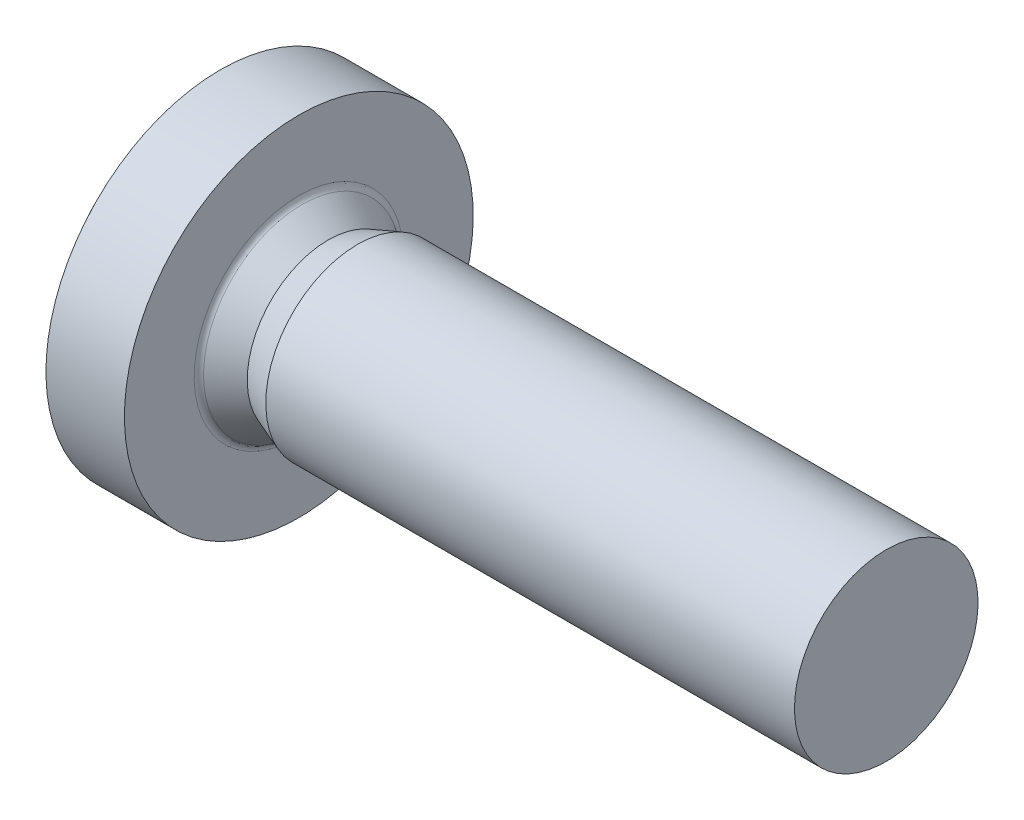
ISO-10303-21;
HEADER;
FILE_DESCRIPTION(('STEP AP214'),'2;1');
FILE_NAME('part.step','',(''),(''),'','','');
FILE_SCHEMA(('AUTOMOTIVE_DESIGN { 1 0 10303 214 1 1 1 1 }'));
ENDSEC;
DATA;
#1=APPLICATION_CONTEXT('core data for automotive mechanical design processes');
#2=APPLICATION_PROTOCOL_DEFINITION('international standard','automotive_design',2000,#1);
#3=PRODUCT_CONTEXT('',#1,'mechanical');
#4=PRODUCT('Part','Part','',(#3));
#5=PRODUCT_RELATED_PRODUCT_CATEGORY('part','',(#4));
#6=PRODUCT_DEFINITION_FORMATION('','',#4);
#7=PRODUCT_DEFINITION_CONTEXT('part definition',#1,'design');
#8=PRODUCT_DEFINITION('design','',#6,#7);
#9=PRODUCT_DEFINITION_SHAPE('','',#8);
#10=(LENGTH_UNIT() NAMED_UNIT(*) SI_UNIT(.MILLI.,.METRE.));
#11=(NAMED_UNIT(*) PLANE_ANGLE_UNIT() SI_UNIT($,.RADIAN.));
#12=(NAMED_UNIT(*) SI_UNIT($,.STERADIAN.) SOLID_ANGLE_UNIT());
#13=UNCERTAINTY_MEASURE_WITH_UNIT(LENGTH_MEASURE(1.E-05),#10,'distance_accuracy_value','');
#14=(GEOMETRIC_REPRESENTATION_CONTEXT(3) GLOBAL_UNCERTAINTY_ASSIGNED_CONTEXT((#13)) GLOBAL_UNIT_ASSIGNED_CONTEXT((#10,
#11,#12)) REPRESENTATION_CONTEXT('',''));
#15=CARTESIAN_POINT('',(0.,0.,0.));
#16=DIRECTION('',(0.,0.,1.));
#17=DIRECTION('',(1.,0.,0.));
#18=AXIS2_PLACEMENT_3D('',#15,#16,#17);
#19=CARTESIAN_POINT('',(16.,1.25,0.));
#20=DIRECTION('',(1.,0.,0.));
#21=DIRECTION('',(0.,1.,0.));
#22=AXIS2_PLACEMENT_3D('',#19,#20,#21);
#23=PLANE('',#22);
#24=CARTESIAN_POINT('',(16.,0.,0.));
#25=DIRECTION('',(1.,0.,0.));
#26=DIRECTION('',(0.,1.,0.));
#27=AXIS2_PLACEMENT_3D('',#24,#25,#26);
#28=CIRCLE('',#27,2.5);
#29=CARTESIAN_POINT('',(16.,2.5,0.));
#30=VERTEX_POINT('',#29);
#31=EDGE_CURVE('E11',#30,#30,#28,.T.);
#32=ORIENTED_EDGE('',*,*,#31,.T.);
#33=EDGE_LOOP('',(#32));
#34=FACE_BOUND('',#33,.T.);
#35=ADVANCED_FACE('F19',(#34),#23,.T.);
#36=CARTESIAN_POINT('',(8.8,0.,0.));
#37=DIRECTION('',(-1.,0.,0.));
#38=DIRECTION('',(0.,1.,0.));
#39=AXIS2_PLACEMENT_3D('',#36,#37,#38);
#40=CYLINDRICAL_SURFACE('',#39,2.5);
#41=CARTESIAN_POINT('',(1.6,0.,0.));
#42=DIRECTION('',(1.,0.,0.));
#43=DIRECTION('',(0.,1.,0.));
#44=AXIS2_PLACEMENT_3D('',#41,#42,#43);
#45=CIRCLE('',#44,2.5);
#46=CARTESIAN_POINT('',(1.6,2.5,0.));
#47=VERTEX_POINT('',#46);
#48=EDGE_CURVE('E29',#47,#47,#45,.T.);
#49=ORIENTED_EDGE('',*,*,#48,.T.);
#50=EDGE_LOOP('',(#49));
#51=FACE_BOUND('',#50,.T.);
#52=ORIENTED_EDGE('',*,*,#31,.F.);
#53=EDGE_LOOP('',(#52));
#54=FACE_BOUND('',#53,.T.);
#55=ADVANCED_FACE('F375',(#51,#54),#40,.T.);
#56=CARTESIAN_POINT('',(1.2,0.,0.));
#57=DIRECTION('',(1.,0.,0.));
#58=DIRECTION('',(0.,1.,0.));
#59=AXIS2_PLACEMENT_3D('',#56,#57,#58);
#60=CONICAL_SURFACE('',#59,2.352125,0.35410502091143);
#61=CARTESIAN_POINT('',(0.8,0.,0.));
#62=DIRECTION('',(1.,0.,0.));
#63=DIRECTION('',(0.,1.,0.));
#64=AXIS2_PLACEMENT_3D('',#61,#62,#63);
#65=CIRCLE('',#64,2.20425);
#66=CARTESIAN_POINT('',(0.8,2.20425,0.));
#67=VERTEX_POINT('',#66);
#68=EDGE_CURVE('E212',#67,#67,#65,.T.);
#69=ORIENTED_EDGE('',*,*,#68,.T.);
#70=EDGE_LOOP('',(#69));
#71=FACE_BOUND('',#70,.T.);
#72=ORIENTED_EDGE('',*,*,#48,.F.);
#73=EDGE_LOOP('',(#72));
#74=FACE_BOUND('',#73,.T.);
#75=ADVANCED_FACE('F379',(#71,#74),#60,.T.);
#76=CARTESIAN_POINT('',(0.444096618275084,0.,0.));
#77=DIRECTION('',(-1.,0.,0.));
#78=DIRECTION('',(0.,1.,0.));
#79=AXIS2_PLACEMENT_3D('',#76,#77,#78);
#80=CONICAL_SURFACE('',#79,2.44421051446388,0.593220065438029);
#81=CARTESIAN_POINT('',(0.0881932365501674,0.,0.));
#82=DIRECTION('',(1.,0.,0.));
#83=DIRECTION('',(0.,1.,0.));
#84=AXIS2_PLACEMENT_3D('',#81,#82,#83);
#85=CIRCLE('',#84,2.68417102892776);
#86=CARTESIAN_POINT('',(0.088193236550167,2.68417102892776,0.));
#87=VERTEX_POINT('',#86);
#88=EDGE_CURVE('E180',#87,#87,#85,.T.);
#89=ORIENTED_EDGE('',*,*,#88,.T.);
#90=EDGE_LOOP('',(#89));
#91=FACE_BOUND('',#90,.T.);
#92=ORIENTED_EDGE('',*,*,#68,.F.);
#93=EDGE_LOOP('',(#92));
#94=FACE_BOUND('',#93,.T.);
#95=ADVANCED_FACE('F421',(#91,#94),#80,.T.);
#96=CARTESIAN_POINT('',(0.2,0.,0.));
#97=DIRECTION('',(1.,0.,0.));
#98=DIRECTION('',(0.,0.,-1.));
#99=AXIS2_PLACEMENT_3D('',#96,#97,#98);
#100=TOROIDAL_SURFACE('',#99,2.85,0.2);
#101=CARTESIAN_POINT('',(0.,0.,0.));
#102=DIRECTION('',(1.,0.,0.));
#103=DIRECTION('',(0.,1.,0.));
#104=AXIS2_PLACEMENT_3D('',#101,#102,#103);
#105=CIRCLE('',#104,2.85);
#106=CARTESIAN_POINT('',(0.,2.85,0.));
#107=VERTEX_POINT('',#106);
#108=EDGE_CURVE('E178',#107,#107,#105,.T.);
#109=ORIENTED_EDGE('',*,*,#108,.T.);
#110=EDGE_LOOP('',(#109));
#111=FACE_BOUND('',#110,.T.);
#112=ORIENTED_EDGE('',*,*,#88,.F.);
#113=EDGE_LOOP('',(#112));
#114=FACE_BOUND('',#113,.T.);
#115=ADVANCED_FACE('F425',(#111,#114),#100,.F.);
#116=CARTESIAN_POINT('',(0.,3.8,0.));
#117=DIRECTION('',(1.,0.,0.));
#118=DIRECTION('',(0.,1.,0.));
#119=AXIS2_PLACEMENT_3D('',#116,#117,#118);
#120=PLANE('',#119);
#121=CARTESIAN_POINT('',(0.,0.,0.));
#122=DIRECTION('',(1.,0.,0.));
#123=DIRECTION('',(0.,1.,0.));
#124=AXIS2_PLACEMENT_3D('',#121,#122,#123);
#125=CIRCLE('',#124,4.75);
#126=CARTESIAN_POINT('',(0.,4.75,0.));
#127=VERTEX_POINT('',#126);
#128=EDGE_CURVE('E181',#127,#127,#125,.T.);
#129=ORIENTED_EDGE('',*,*,#128,.T.);
#130=EDGE_LOOP('',(#129));
#131=FACE_BOUND('',#130,.T.);
#132=ORIENTED_EDGE('',*,*,#108,.F.);
#133=EDGE_LOOP('',(#132));
#134=FACE_BOUND('',#133,.T.);
#135=ADVANCED_FACE('F435',(#131,#134),#120,.T.);
#136=CARTESIAN_POINT('',(-1.06859829739593,0.,0.));
#137=DIRECTION('',(-1.,0.,0.));
#138=DIRECTION('',(0.,1.,0.));
#139=AXIS2_PLACEMENT_3D('',#136,#137,#138);
#140=CYLINDRICAL_SURFACE('',#139,4.75);
#141=CARTESIAN_POINT('',(-2.13719659479187,0.,0.));
#142=DIRECTION('',(1.,0.,0.));
#143=DIRECTION('',(0.,1.,0.));
#144=AXIS2_PLACEMENT_3D('',#141,#142,#143);
#145=CIRCLE('',#144,4.75);
#146=CARTESIAN_POINT('',(-2.13719659479186,4.75,0.));
#147=VERTEX_POINT('',#146);
#148=EDGE_CURVE('E261',#147,#147,#145,.T.);
#149=ORIENTED_EDGE('',*,*,#148,.T.);
#150=EDGE_LOOP('',(#149));
#151=FACE_BOUND('',#150,.T.);
#152=ORIENTED_EDGE('',*,*,#128,.F.);
#153=EDGE_LOOP('',(#152));
#154=FACE_BOUND('',#153,.T.);
#155=ADVANCED_FACE('F408',(#151,#154),#140,.T.);
#156=CARTESIAN_POINT('',(4.3,0.,0.));
#157=DIRECTION('',(0.,0.,1.));
#158=DIRECTION('',(1.,0.,0.));
#159=AXIS2_PLACEMENT_3D('',#156,#157,#158);
#160=SPHERICAL_SURFACE('',#159,8.);
#161=ORIENTED_EDGE('',*,*,#148,.F.);
#162=EDGE_LOOP('',(#161));
#163=FACE_BOUND('',#162,.T.);
#164=CARTESIAN_POINT('',(4.3,2.45,0.));
#165=DIRECTION('',(0.,1.,0.));
#166=DIRECTION('',(0.,0.,-1.));
#167=AXIS2_PLACEMENT_3D('',#164,#165,#166);
#168=CIRCLE('',#167,7.61560897105412);
#169=CARTESIAN_POINT('',(-3.29982894544345,2.45,-0.49));
#170=VERTEX_POINT('',#169);
#171=CARTESIAN_POINT('',(-3.29982894544345,2.45,0.49));
#172=VERTEX_POINT('',#171);
#173=EDGE_CURVE('E158',#170,#172,#168,.T.);
#174=ORIENTED_EDGE('',*,*,#173,.T.);
#175=CARTESIAN_POINT('',(4.3,-0.0239333009683529,0.273558881846001));
#176=DIRECTION('',(0.,-0.0871557427476582,0.996194698091746));
#177=DIRECTION('',(0.,0.996194698091746,0.0871557427476582));
#178=AXIS2_PLACEMENT_3D('',#175,#176,#177);
#179=CIRCLE('',#178,7.99528565688981);
#180=CARTESIAN_POINT('',(-3.63151915239101,0.98,0.361391664616892));
#181=VERTEX_POINT('',#180);
#182=EDGE_CURVE('E142',#172,#181,#179,.T.);
#183=ORIENTED_EDGE('',*,*,#182,.T.);
#184=CARTESIAN_POINT('',(4.3,0.401487181137087,0.695396196317044));
#185=DIRECTION('',(0.,0.5,0.866025403784439));
#186=DIRECTION('',(0.,0.866025403784439,-0.5));
#187=AXIS2_PLACEMENT_3D('',#184,#185,#186);
#188=CIRCLE('',#187,7.95960000084994);
#189=CARTESIAN_POINT('',(-3.65669151886433,0.587818030359914,0.587818030359914));
#190=VERTEX_POINT('',#189);
#191=EDGE_CURVE('E197',#181,#190,#188,.T.);
#192=ORIENTED_EDGE('',*,*,#191,.T.);
#193=CARTESIAN_POINT('',(4.3,0.695396196317044,0.401487181137087));
#194=DIRECTION('',(0.,0.866025403784439,0.5));
#195=DIRECTION('',(0.,0.5,-0.866025403784439));
#196=AXIS2_PLACEMENT_3D('',#193,#194,#195);
#197=CIRCLE('',#196,7.95960000084994);
#198=CARTESIAN_POINT('',(-3.63151915239101,0.361391664616892,0.98));
#199=VERTEX_POINT('',#198);
#200=EDGE_CURVE('E312',#190,#199,#197,.T.);
#201=ORIENTED_EDGE('',*,*,#200,.T.);
#202=CARTESIAN_POINT('',(4.3,0.273558881846001,-0.0239333009683528));
#203=DIRECTION('',(0.,0.996194698091746,-0.0871557427476583));
#204=DIRECTION('',(0.,-0.0871557427476583,-0.996194698091746));
#205=AXIS2_PLACEMENT_3D('',#202,#203,#204);
#206=CIRCLE('',#205,7.99528565688981);
#207=CARTESIAN_POINT('',(-3.29982894544345,0.49,2.45));
#208=VERTEX_POINT('',#207);
#209=EDGE_CURVE('E185',#199,#208,#206,.T.);
#210=ORIENTED_EDGE('',*,*,#209,.T.);
#211=CARTESIAN_POINT('',(4.3,0.,2.45));
#212=DIRECTION('',(0.,0.,1.));
#213=DIRECTION('',(0.,1.,0.));
#214=AXIS2_PLACEMENT_3D('',#211,#212,#213);
#215=CIRCLE('',#214,7.61560897105412);
#216=CARTESIAN_POINT('',(-3.29982894544345,-0.49,2.45));
#217=VERTEX_POINT('',#216);
#218=EDGE_CURVE('E256',#208,#217,#215,.T.);
#219=ORIENTED_EDGE('',*,*,#218,.T.);
#220=CARTESIAN_POINT('',(4.3,-0.273558881846001,-0.0239333009683528));
#221=DIRECTION('',(0.,-0.996194698091746,-0.0871557427476581));
#222=DIRECTION('',(0.,-0.0871557427476581,0.996194698091746));
#223=AXIS2_PLACEMENT_3D('',#220,#221,#222);
#224=CIRCLE('',#223,7.99528565688981);
#225=CARTESIAN_POINT('',(-3.63151915239101,-0.361391664616892,0.98));
#226=VERTEX_POINT('',#225);
#227=EDGE_CURVE('E217',#217,#226,#224,.T.);
#228=ORIENTED_EDGE('',*,*,#227,.T.);
#229=CARTESIAN_POINT('',(4.3,-0.695396196317044,0.401487181137087));
#230=DIRECTION('',(0.,-0.866025403784439,0.5));
#231=DIRECTION('',(0.,0.5,0.866025403784439));
#232=AXIS2_PLACEMENT_3D('',#229,#230,#231);
#233=CIRCLE('',#232,7.95960000084994);
#234=CARTESIAN_POINT('',(-3.65669151886433,-0.587818030359914,0.587818030359914));
#235=VERTEX_POINT('',#234);
#236=EDGE_CURVE('E296',#226,#235,#233,.T.);
#237=ORIENTED_EDGE('',*,*,#236,.T.);
#238=CARTESIAN_POINT('',(4.3,-0.401487181137088,0.695396196317045));
#239=DIRECTION('',(0.,-0.5,0.866025403784439));
#240=DIRECTION('',(0.,0.866025403784439,0.5));
#241=AXIS2_PLACEMENT_3D('',#238,#239,#240);
#242=CIRCLE('',#241,7.95960000084994);
#243=CARTESIAN_POINT('',(-3.63151915239101,-0.98,0.361391664616892));
#244=VERTEX_POINT('',#243);
#245=EDGE_CURVE('E302',#235,#244,#242,.T.);
#246=ORIENTED_EDGE('',*,*,#245,.T.);
#247=CARTESIAN_POINT('',(4.3,0.0239333009683529,0.273558881846002));
#248=DIRECTION('',(0.,0.0871557427476582,0.996194698091746));
#249=DIRECTION('',(0.,0.996194698091746,-0.0871557427476582));
#250=AXIS2_PLACEMENT_3D('',#247,#248,#249);
#251=CIRCLE('',#250,7.99528565688981);
#252=CARTESIAN_POINT('',(-3.29982894544345,-2.45,0.49));
#253=VERTEX_POINT('',#252);
#254=EDGE_CURVE('E161',#244,#253,#251,.T.);
#255=ORIENTED_EDGE('',*,*,#254,.T.);
#256=CARTESIAN_POINT('',(4.3,-2.45,0.));
#257=DIRECTION('',(0.,-1.,0.));
#258=DIRECTION('',(0.,0.,1.));
#259=AXIS2_PLACEMENT_3D('',#256,#257,#258);
#260=CIRCLE('',#259,7.61560897105412);
#261=CARTESIAN_POINT('',(-3.29982894544345,-2.45,-0.49));
#262=VERTEX_POINT('',#261);
#263=EDGE_CURVE('E308',#253,#262,#260,.T.);
#264=ORIENTED_EDGE('',*,*,#263,.T.);
#265=CARTESIAN_POINT('',(4.3,0.0239333009683527,-0.273558881846001));
#266=DIRECTION('',(0.,0.087155742747658,-0.996194698091746));
#267=DIRECTION('',(0.,-0.996194698091746,-0.087155742747658));
#268=AXIS2_PLACEMENT_3D('',#265,#266,#267);
#269=CIRCLE('',#268,7.99528565688981);
#270=CARTESIAN_POINT('',(-3.63151915239101,-0.98,-0.361391664616892));
#271=VERTEX_POINT('',#270);
#272=EDGE_CURVE('E269',#262,#271,#269,.T.);
#273=ORIENTED_EDGE('',*,*,#272,.T.);
#274=CARTESIAN_POINT('',(4.3,-0.401487181137087,-0.695396196317044));
#275=DIRECTION('',(0.,-0.5,-0.866025403784439));
#276=DIRECTION('',(0.,-0.866025403784439,0.5));
#277=AXIS2_PLACEMENT_3D('',#274,#275,#276);
#278=CIRCLE('',#277,7.95960000084994);
#279=CARTESIAN_POINT('',(-3.65669151886433,-0.587818030359914,-0.587818030359913));
#280=VERTEX_POINT('',#279);
#281=EDGE_CURVE('E230',#271,#280,#278,.T.);
#282=ORIENTED_EDGE('',*,*,#281,.T.);
#283=CARTESIAN_POINT('',(4.3,-0.695396196317044,-0.401487181137087));
#284=DIRECTION('',(0.,-0.866025403784439,-0.5));
#285=DIRECTION('',(0.,-0.5,0.866025403784439));
#286=AXIS2_PLACEMENT_3D('',#283,#284,#285);
#287=CIRCLE('',#286,7.95960000084994);
#288=CARTESIAN_POINT('',(-3.63151915239101,-0.361391664616892,-0.98));
#289=VERTEX_POINT('',#288);
#290=EDGE_CURVE('E285',#280,#289,#287,.T.);
#291=ORIENTED_EDGE('',*,*,#290,.T.);
#292=CARTESIAN_POINT('',(4.3,-0.273558881846001,0.0239333009683528));
#293=DIRECTION('',(0.,-0.996194698091746,0.0871557427476582));
#294=DIRECTION('',(0.,0.0871557427476582,0.996194698091746));
#295=AXIS2_PLACEMENT_3D('',#292,#293,#294);
#296=CIRCLE('',#295,7.99528565688981);
#297=CARTESIAN_POINT('',(-3.29982894544345,-0.49,-2.45));
#298=VERTEX_POINT('',#297);
#299=EDGE_CURVE('E274',#289,#298,#296,.T.);
#300=ORIENTED_EDGE('',*,*,#299,.T.);
#301=CARTESIAN_POINT('',(4.3,0.,-2.45));
#302=DIRECTION('',(0.,0.,-1.));
#303=DIRECTION('',(0.,-1.,0.));
#304=AXIS2_PLACEMENT_3D('',#301,#302,#303);
#305=CIRCLE('',#304,7.61560897105412);
#306=CARTESIAN_POINT('',(-3.29982894544345,0.49,-2.45));
#307=VERTEX_POINT('',#306);
#308=EDGE_CURVE('E191',#298,#307,#305,.T.);
#309=ORIENTED_EDGE('',*,*,#308,.T.);
#310=CARTESIAN_POINT('',(4.3,0.273558881846001,0.0239333009683529));
#311=DIRECTION('',(0.,0.996194698091746,0.0871557427476582));
#312=DIRECTION('',(0.,0.0871557427476582,-0.996194698091746));
#313=AXIS2_PLACEMENT_3D('',#310,#311,#312);
#314=CIRCLE('',#313,7.99528565688981);
#315=CARTESIAN_POINT('',(-3.63151915239101,0.361391664616892,-0.98));
#316=VERTEX_POINT('',#315);
#317=EDGE_CURVE('E221',#307,#316,#314,.T.);
#318=ORIENTED_EDGE('',*,*,#317,.T.);
#319=CARTESIAN_POINT('',(4.3,0.695396196317044,-0.401487181137087));
#320=DIRECTION('',(0.,0.866025403784439,-0.5));
#321=DIRECTION('',(0.,-0.5,-0.866025403784439));
#322=AXIS2_PLACEMENT_3D('',#319,#320,#321);
#323=CIRCLE('',#322,7.95960000084994);
#324=CARTESIAN_POINT('',(-3.65669151886433,0.587818030359913,-0.587818030359914));
#325=VERTEX_POINT('',#324);
#326=EDGE_CURVE('E222',#316,#325,#323,.T.);
#327=ORIENTED_EDGE('',*,*,#326,.T.);
#328=CARTESIAN_POINT('',(4.3,0.401487181137088,-0.695396196317044));
#329=DIRECTION('',(0.,0.5,-0.866025403784438));
#330=DIRECTION('',(0.,-0.866025403784438,-0.5));
#331=AXIS2_PLACEMENT_3D('',#328,#329,#330);
#332=CIRCLE('',#331,7.95960000084994);
#333=CARTESIAN_POINT('',(-3.63151915239101,0.98,-0.361391664616892));
#334=VERTEX_POINT('',#333);
#335=EDGE_CURVE('E208',#325,#334,#332,.T.);
#336=ORIENTED_EDGE('',*,*,#335,.T.);
#337=CARTESIAN_POINT('',(4.3,-0.0239333009683528,-0.273558881846));
#338=DIRECTION('',(0.,-0.0871557427476583,-0.996194698091746));
#339=DIRECTION('',(0.,-0.996194698091746,0.0871557427476583));
#340=AXIS2_PLACEMENT_3D('',#337,#338,#339);
#341=CIRCLE('',#340,7.99528565688981);
#342=EDGE_CURVE('E166',#334,#170,#341,.T.);
#343=ORIENTED_EDGE('',*,*,#342,.T.);
#344=EDGE_LOOP('',(#174,#183,#192,#201,#210,#219,#228,#237,#246,#255,#264,#273,#282,#291,#300,
#309,#318,#327,#336,#343));
#345=FACE_BOUND('',#344,.T.);
#346=ADVANCED_FACE('F164',(#163,#345),#160,.T.);
#347=CARTESIAN_POINT('',(-1.85,0.,0.));
#348=DIRECTION('',(1.,0.,0.));
#349=DIRECTION('',(0.,0.,-1.));
#350=AXIS2_PLACEMENT_3D('',#347,#348,#349);
#351=PLANE('',#350);
#352=DIRECTION('',(0.,0.,-1.));
#353=VECTOR('',#352,1.);
#354=CARTESIAN_POINT('',(-1.85,2.45,-0.49));
#355=LINE('',#354,#353);
#356=CARTESIAN_POINT('',(-1.85,2.45,0.49));
#357=VERTEX_POINT('',#356);
#358=CARTESIAN_POINT('',(-1.85,2.45,-0.49));
#359=VERTEX_POINT('',#358);
#360=EDGE_CURVE('E160',#357,#359,#355,.T.);
#361=ORIENTED_EDGE('',*,*,#360,.T.);
#362=DIRECTION('',(0.,-0.996194698091746,0.0871557427476583));
#363=VECTOR('',#362,1.);
#364=CARTESIAN_POINT('',(-1.85,2.45,-0.49));
#365=LINE('',#364,#363);
#366=CARTESIAN_POINT('',(-1.85,0.98,-0.361391664616892));
#367=VERTEX_POINT('',#366);
#368=EDGE_CURVE('E170',#359,#367,#365,.T.);
#369=ORIENTED_EDGE('',*,*,#368,.T.);
#370=DIRECTION('',(0.,-0.866025403784438,-0.5));
#371=VECTOR('',#370,1.);
#372=CARTESIAN_POINT('',(-1.85,0.98,-0.361391664616892));
#373=LINE('',#372,#371);
#374=CARTESIAN_POINT('',(-1.85,0.587818030359913,-0.587818030359914));
#375=VERTEX_POINT('',#374);
#376=EDGE_CURVE('E202',#367,#375,#373,.T.);
#377=ORIENTED_EDGE('',*,*,#376,.T.);
#378=DIRECTION('',(0.,-0.5,-0.866025403784439));
#379=VECTOR('',#378,1.);
#380=CARTESIAN_POINT('',(-1.85,0.361391664616892,-0.98));
#381=LINE('',#380,#379);
#382=CARTESIAN_POINT('',(-1.85,0.361391664616892,-0.98));
#383=VERTEX_POINT('',#382);
#384=EDGE_CURVE('E225',#375,#383,#381,.T.);
#385=ORIENTED_EDGE('',*,*,#384,.T.);
#386=DIRECTION('',(0.,0.0871557427476582,-0.996194698091746));
#387=VECTOR('',#386,1.);
#388=CARTESIAN_POINT('',(-1.85,0.49,-2.45));
#389=LINE('',#388,#387);
#390=CARTESIAN_POINT('',(-1.85,0.49,-2.45));
#391=VERTEX_POINT('',#390);
#392=EDGE_CURVE('E238',#383,#391,#389,.T.);
#393=ORIENTED_EDGE('',*,*,#392,.T.);
#394=DIRECTION('',(0.,-1.,0.));
#395=VECTOR('',#394,1.);
#396=CARTESIAN_POINT('',(-1.85,-0.49,-2.45));
#397=LINE('',#396,#395);
#398=CARTESIAN_POINT('',(-1.85,-0.49,-2.45));
#399=VERTEX_POINT('',#398);
#400=EDGE_CURVE('E193',#391,#399,#397,.T.);
#401=ORIENTED_EDGE('',*,*,#400,.T.);
#402=DIRECTION('',(0.,0.0871557427476582,0.996194698091746));
#403=VECTOR('',#402,1.);
#404=CARTESIAN_POINT('',(-1.85,-0.49,-2.45));
#405=LINE('',#404,#403);
#406=CARTESIAN_POINT('',(-1.85,-0.361391664616892,-0.98));
#407=VERTEX_POINT('',#406);
#408=EDGE_CURVE('E248',#399,#407,#405,.T.);
#409=ORIENTED_EDGE('',*,*,#408,.T.);
#410=DIRECTION('',(0.,-0.5,0.866025403784439));
#411=VECTOR('',#410,1.);
#412=CARTESIAN_POINT('',(-1.85,-0.361391664616892,-0.98));
#413=LINE('',#412,#411);
#414=CARTESIAN_POINT('',(-1.85,-0.587818030359914,-0.587818030359913));
#415=VERTEX_POINT('',#414);
#416=EDGE_CURVE('E279',#407,#415,#413,.T.);
#417=ORIENTED_EDGE('',*,*,#416,.T.);
#418=DIRECTION('',(0.,-0.866025403784439,0.5));
#419=VECTOR('',#418,1.);
#420=CARTESIAN_POINT('',(-1.85,-0.98,-0.361391664616892));
#421=LINE('',#420,#419);
#422=CARTESIAN_POINT('',(-1.85,-0.98,-0.361391664616892));
#423=VERTEX_POINT('',#422);
#424=EDGE_CURVE('E266',#415,#423,#421,.T.);
#425=ORIENTED_EDGE('',*,*,#424,.T.);
#426=DIRECTION('',(0.,-0.996194698091746,-0.087155742747658));
#427=VECTOR('',#426,1.);
#428=CARTESIAN_POINT('',(-1.85,-2.45,-0.49));
#429=LINE('',#428,#427);
#430=CARTESIAN_POINT('',(-1.85,-2.45,-0.49));
#431=VERTEX_POINT('',#430);
#432=EDGE_CURVE('E231',#423,#431,#429,.T.);
#433=ORIENTED_EDGE('',*,*,#432,.T.);
#434=DIRECTION('',(0.,0.,1.));
#435=VECTOR('',#434,1.);
#436=CARTESIAN_POINT('',(-1.85,-2.45,0.49));
#437=LINE('',#436,#435);
#438=CARTESIAN_POINT('',(-1.85,-2.45,0.49));
#439=VERTEX_POINT('',#438);
#440=EDGE_CURVE('E270',#431,#439,#437,.T.);
#441=ORIENTED_EDGE('',*,*,#440,.T.);
#442=DIRECTION('',(0.,0.996194698091746,-0.0871557427476581));
#443=VECTOR('',#442,1.);
#444=CARTESIAN_POINT('',(-1.85,-2.45,0.49));
#445=LINE('',#444,#443);
#446=CARTESIAN_POINT('',(-1.85,-0.98,0.361391664616892));
#447=VERTEX_POINT('',#446);
#448=EDGE_CURVE('E177',#439,#447,#445,.T.);
#449=ORIENTED_EDGE('',*,*,#448,.T.);
#450=DIRECTION('',(0.,0.866025403784439,0.5));
#451=VECTOR('',#450,1.);
#452=CARTESIAN_POINT('',(-1.85,-0.98,0.361391664616892));
#453=LINE('',#452,#451);
#454=CARTESIAN_POINT('',(-1.85,-0.587818030359914,0.587818030359914));
#455=VERTEX_POINT('',#454);
#456=EDGE_CURVE('E293',#447,#455,#453,.T.);
#457=ORIENTED_EDGE('',*,*,#456,.T.);
#458=DIRECTION('',(0.,0.5,0.866025403784439));
#459=VECTOR('',#458,1.);
#460=CARTESIAN_POINT('',(-1.85,-0.361391664616892,0.98));
#461=LINE('',#460,#459);
#462=CARTESIAN_POINT('',(-1.85,-0.361391664616892,0.98));
#463=VERTEX_POINT('',#462);
#464=EDGE_CURVE('E214',#455,#463,#461,.T.);
#465=ORIENTED_EDGE('',*,*,#464,.T.);
#466=DIRECTION('',(0.,-0.0871557427476581,0.996194698091746));
#467=VECTOR('',#466,1.);
#468=CARTESIAN_POINT('',(-1.85,-0.49,2.45));
#469=LINE('',#468,#467);
#470=CARTESIAN_POINT('',(-1.85,-0.49,2.45));
#471=VERTEX_POINT('',#470);
#472=EDGE_CURVE('E253',#463,#471,#469,.T.);
#473=ORIENTED_EDGE('',*,*,#472,.T.);
#474=DIRECTION('',(0.,1.,0.));
#475=VECTOR('',#474,1.);
#476=CARTESIAN_POINT('',(-1.85,0.49,2.45));
#477=LINE('',#476,#475);
#478=CARTESIAN_POINT('',(-1.85,0.49,2.45));
#479=VERTEX_POINT('',#478);
#480=EDGE_CURVE('E182',#471,#479,#477,.T.);
#481=ORIENTED_EDGE('',*,*,#480,.T.);
#482=DIRECTION('',(0.,-0.0871557427476583,-0.996194698091746));
#483=VECTOR('',#482,1.);
#484=CARTESIAN_POINT('',(-1.85,0.49,2.45));
#485=LINE('',#484,#483);
#486=CARTESIAN_POINT('',(-1.85,0.361391664616892,0.98));
#487=VERTEX_POINT('',#486);
#488=EDGE_CURVE('E314',#479,#487,#485,.T.);
#489=ORIENTED_EDGE('',*,*,#488,.T.);
#490=DIRECTION('',(0.,0.5,-0.866025403784439));
#491=VECTOR('',#490,1.);
#492=CARTESIAN_POINT('',(-1.85,0.361391664616892,0.98));
#493=LINE('',#492,#491);
#494=CARTESIAN_POINT('',(-1.85,0.587818030359914,0.587818030359914));
#495=VERTEX_POINT('',#494);
#496=EDGE_CURVE('E240',#487,#495,#493,.T.);
#497=ORIENTED_EDGE('',*,*,#496,.T.);
#498=DIRECTION('',(0.,0.866025403784439,-0.5));
#499=VECTOR('',#498,1.);
#500=CARTESIAN_POINT('',(-1.85,0.98,0.361391664616892));
#501=LINE('',#500,#499);
#502=CARTESIAN_POINT('',(-1.85,0.98,0.361391664616892));
#503=VERTEX_POINT('',#502);
#504=EDGE_CURVE('E153',#495,#503,#501,.T.);
#505=ORIENTED_EDGE('',*,*,#504,.T.);
#506=DIRECTION('',(0.,0.996194698091746,0.0871557427476582));
#507=VECTOR('',#506,1.);
#508=CARTESIAN_POINT('',(-1.85,2.45,0.49));
#509=LINE('',#508,#507);
#510=EDGE_CURVE('E152',#503,#357,#509,.T.);
#511=ORIENTED_EDGE('',*,*,#510,.T.);
#512=EDGE_LOOP('',(#361,#369,#377,#385,#393,#401,#409,#417,#425,#433,#441,#449,#457,#465,#473,
#481,#489,#497,#505,#511));
#513=FACE_BOUND('',#512,.T.);
#514=ADVANCED_FACE('F350',(#513),#351,.F.);
#515=CARTESIAN_POINT('',(-4.07,1.715,0.425695832308446));
#516=DIRECTION('',(0.,-0.0871557427476582,0.996194698091746));
#517=DIRECTION('',(0.,-0.996194698091746,-0.0871557427476582));
#518=AXIS2_PLACEMENT_3D('',#515,#516,#517);
#519=PLANE('',#518);
#520=ORIENTED_EDGE('',*,*,#182,.F.);
#521=DIRECTION('',(1.,0.,0.));
#522=VECTOR('',#521,1.);
#523=CARTESIAN_POINT('',(-4.07,2.45,0.49));
#524=LINE('',#523,#522);
#525=EDGE_CURVE('E145',#172,#357,#524,.T.);
#526=ORIENTED_EDGE('',*,*,#525,.T.);
#527=ORIENTED_EDGE('',*,*,#510,.F.);
#528=DIRECTION('',(1.,0.,0.));
#529=VECTOR('',#528,1.);
#530=CARTESIAN_POINT('',(-4.07,0.98,0.361391664616892));
#531=LINE('',#530,#529);
#532=EDGE_CURVE('E148',#181,#503,#531,.T.);
#533=ORIENTED_EDGE('',*,*,#532,.F.);
#534=EDGE_LOOP('',(#520,#526,#527,#533));
#535=FACE_BOUND('',#534,.T.);
#536=ADVANCED_FACE('F144',(#535),#519,.F.);
#537=CARTESIAN_POINT('',(-4.07,0.783909015179957,0.474604847488403));
#538=DIRECTION('',(0.,0.5,0.866025403784439));
#539=DIRECTION('',(0.,-0.866025403784439,0.5));
#540=AXIS2_PLACEMENT_3D('',#537,#538,#539);
#541=PLANE('',#540);
#542=ORIENTED_EDGE('',*,*,#191,.F.);
#543=ORIENTED_EDGE('',*,*,#532,.T.);
#544=ORIENTED_EDGE('',*,*,#504,.F.);
#545=DIRECTION('',(1.,0.,0.));
#546=VECTOR('',#545,1.);
#547=CARTESIAN_POINT('',(-4.07,0.587818030359914,0.587818030359913));
#548=LINE('',#547,#546);
#549=EDGE_CURVE('E243',#190,#495,#548,.T.);
#550=ORIENTED_EDGE('',*,*,#549,.F.);
#551=EDGE_LOOP('',(#542,#543,#544,#550));
#552=FACE_BOUND('',#551,.T.);
#553=ADVANCED_FACE('F361',(#552),#541,.F.);
#554=CARTESIAN_POINT('',(-4.07,0.474604847488403,0.783909015179957));
#555=DIRECTION('',(0.,0.866025403784439,0.5));
#556=DIRECTION('',(0.,-0.5,0.866025403784439));
#557=AXIS2_PLACEMENT_3D('',#554,#555,#556);
#558=PLANE('',#557);
#559=ORIENTED_EDGE('',*,*,#200,.F.);
#560=ORIENTED_EDGE('',*,*,#549,.T.);
#561=ORIENTED_EDGE('',*,*,#496,.F.);
#562=DIRECTION('',(1.,0.,0.));
#563=VECTOR('',#562,1.);
#564=CARTESIAN_POINT('',(-4.07,0.361391664616892,0.98));
#565=LINE('',#564,#563);
#566=EDGE_CURVE('E299',#199,#487,#565,.T.);
#567=ORIENTED_EDGE('',*,*,#566,.F.);
#568=EDGE_LOOP('',(#559,#560,#561,#567));
#569=FACE_BOUND('',#568,.T.);
#570=ADVANCED_FACE('F348',(#569),#558,.F.);
#571=CARTESIAN_POINT('',(-4.07,0.425695832308446,1.715));
#572=DIRECTION('',(0.,0.996194698091746,-0.0871557427476583));
#573=DIRECTION('',(0.,0.0871557427476583,0.996194698091746));
#574=AXIS2_PLACEMENT_3D('',#571,#572,#573);
#575=PLANE('',#574);
#576=ORIENTED_EDGE('',*,*,#209,.F.);
#577=ORIENTED_EDGE('',*,*,#566,.T.);
#578=ORIENTED_EDGE('',*,*,#488,.F.);
#579=DIRECTION('',(1.,0.,0.));
#580=VECTOR('',#579,1.);
#581=CARTESIAN_POINT('',(-4.07,0.49,2.45));
#582=LINE('',#581,#580);
#583=EDGE_CURVE('E186',#208,#479,#582,.T.);
#584=ORIENTED_EDGE('',*,*,#583,.F.);
#585=EDGE_LOOP('',(#576,#577,#578,#584));
#586=FACE_BOUND('',#585,.T.);
#587=ADVANCED_FACE('F342',(#586),#575,.F.);
#588=CARTESIAN_POINT('',(-4.07,0.,2.45));
#589=DIRECTION('',(0.,0.,1.));
#590=DIRECTION('',(0.,-1.,0.));
#591=AXIS2_PLACEMENT_3D('',#588,#589,#590);
#592=PLANE('',#591);
#593=ORIENTED_EDGE('',*,*,#218,.F.);
#594=ORIENTED_EDGE('',*,*,#583,.T.);
#595=ORIENTED_EDGE('',*,*,#480,.F.);
#596=DIRECTION('',(1.,0.,0.));
#597=VECTOR('',#596,1.);
#598=CARTESIAN_POINT('',(-4.07,-0.49,2.45));
#599=LINE('',#598,#597);
#600=EDGE_CURVE('E245',#217,#471,#599,.T.);
#601=ORIENTED_EDGE('',*,*,#600,.F.);
#602=EDGE_LOOP('',(#593,#594,#595,#601));
#603=FACE_BOUND('',#602,.T.);
#604=ADVANCED_FACE('F356',(#603),#592,.F.);
#605=CARTESIAN_POINT('',(-4.07,-0.425695832308446,1.715));
#606=DIRECTION('',(0.,-0.996194698091746,-0.0871557427476581));
#607=DIRECTION('',(0.,0.0871557427476581,-0.996194698091746));
#608=AXIS2_PLACEMENT_3D('',#605,#606,#607);
#609=PLANE('',#608);
#610=ORIENTED_EDGE('',*,*,#227,.F.);
#611=ORIENTED_EDGE('',*,*,#600,.T.);
#612=ORIENTED_EDGE('',*,*,#472,.F.);
#613=DIRECTION('',(1.,0.,0.));
#614=VECTOR('',#613,1.);
#615=CARTESIAN_POINT('',(-4.07,-0.361391664616892,0.98));
#616=LINE('',#615,#614);
#617=EDGE_CURVE('E218',#226,#463,#616,.T.);
#618=ORIENTED_EDGE('',*,*,#617,.F.);
#619=EDGE_LOOP('',(#610,#611,#612,#618));
#620=FACE_BOUND('',#619,.T.);
#621=ADVANCED_FACE('F411',(#620),#609,.F.);
#622=CARTESIAN_POINT('',(-4.07,-0.474604847488403,0.783909015179957));
#623=DIRECTION('',(0.,-0.866025403784439,0.5));
#624=DIRECTION('',(0.,-0.5,-0.866025403784439));
#625=AXIS2_PLACEMENT_3D('',#622,#623,#624);
#626=PLANE('',#625);
#627=ORIENTED_EDGE('',*,*,#236,.F.);
#628=ORIENTED_EDGE('',*,*,#617,.T.);
#629=ORIENTED_EDGE('',*,*,#464,.F.);
#630=DIRECTION('',(1.,0.,0.));
#631=VECTOR('',#630,1.);
#632=CARTESIAN_POINT('',(-4.07,-0.587818030359914,0.587818030359914));
#633=LINE('',#632,#631);
#634=EDGE_CURVE('E297',#235,#455,#633,.T.);
#635=ORIENTED_EDGE('',*,*,#634,.F.);
#636=EDGE_LOOP('',(#627,#628,#629,#635));
#637=FACE_BOUND('',#636,.T.);
#638=ADVANCED_FACE('F388',(#637),#626,.F.);
#639=CARTESIAN_POINT('',(-4.07,-0.783909015179957,0.474604847488403));
#640=DIRECTION('',(0.,-0.5,0.866025403784439));
#641=DIRECTION('',(0.,-0.866025403784439,-0.5));
#642=AXIS2_PLACEMENT_3D('',#639,#640,#641);
#643=PLANE('',#642);
#644=ORIENTED_EDGE('',*,*,#245,.F.);
#645=ORIENTED_EDGE('',*,*,#634,.T.);
#646=ORIENTED_EDGE('',*,*,#456,.F.);
#647=DIRECTION('',(1.,0.,0.));
#648=VECTOR('',#647,1.);
#649=CARTESIAN_POINT('',(-4.07,-0.98,0.361391664616892));
#650=LINE('',#649,#648);
#651=EDGE_CURVE('E174',#244,#447,#650,.T.);
#652=ORIENTED_EDGE('',*,*,#651,.F.);
#653=EDGE_LOOP('',(#644,#645,#646,#652));
#654=FACE_BOUND('',#653,.T.);
#655=ADVANCED_FACE('F385',(#654),#643,.F.);
#656=CARTESIAN_POINT('',(-4.07,-1.715,0.425695832308446));
#657=DIRECTION('',(0.,0.0871557427476582,0.996194698091746));
#658=DIRECTION('',(0.,-0.996194698091746,0.0871557427476582));
#659=AXIS2_PLACEMENT_3D('',#656,#657,#658);
#660=PLANE('',#659);
#661=ORIENTED_EDGE('',*,*,#254,.F.);
#662=ORIENTED_EDGE('',*,*,#651,.T.);
#663=ORIENTED_EDGE('',*,*,#448,.F.);
#664=DIRECTION('',(1.,0.,0.));
#665=VECTOR('',#664,1.);
#666=CARTESIAN_POINT('',(-4.07,-2.45,0.49));
#667=LINE('',#666,#665);
#668=EDGE_CURVE('E273',#253,#439,#667,.T.);
#669=ORIENTED_EDGE('',*,*,#668,.F.);
#670=EDGE_LOOP('',(#661,#662,#663,#669));
#671=FACE_BOUND('',#670,.T.);
#672=ADVANCED_FACE('F372',(#671),#660,.F.);
#673=CARTESIAN_POINT('',(-4.07,2.45,0.));
#674=DIRECTION('',(0.,1.,0.));
#675=DIRECTION('',(0.,0.,1.));
#676=AXIS2_PLACEMENT_3D('',#673,#674,#675);
#677=PLANE('',#676);
#678=ORIENTED_EDGE('',*,*,#173,.F.);
#679=DIRECTION('',(1.,0.,0.));
#680=VECTOR('',#679,1.);
#681=CARTESIAN_POINT('',(-4.07,2.45,-0.49));
#682=LINE('',#681,#680);
#683=EDGE_CURVE('E167',#170,#359,#682,.T.);
#684=ORIENTED_EDGE('',*,*,#683,.T.);
#685=ORIENTED_EDGE('',*,*,#360,.F.);
#686=ORIENTED_EDGE('',*,*,#525,.F.);
#687=EDGE_LOOP('',(#678,#684,#685,#686));
#688=FACE_BOUND('',#687,.T.);
#689=ADVANCED_FACE('F156',(#688),#677,.F.);
#690=CARTESIAN_POINT('',(-4.07,1.715,-0.425695832308446));
#691=DIRECTION('',(0.,-0.0871557427476583,-0.996194698091746));
#692=DIRECTION('',(0.,0.996194698091746,-0.0871557427476583));
#693=AXIS2_PLACEMENT_3D('',#690,#691,#692);
#694=PLANE('',#693);
#695=ORIENTED_EDGE('',*,*,#342,.F.);
#696=DIRECTION('',(1.,0.,0.));
#697=VECTOR('',#696,1.);
#698=CARTESIAN_POINT('',(-4.07,0.98,-0.361391664616892));
#699=LINE('',#698,#697);
#700=EDGE_CURVE('E200',#334,#367,#699,.T.);
#701=ORIENTED_EDGE('',*,*,#700,.T.);
#702=ORIENTED_EDGE('',*,*,#368,.F.);
#703=ORIENTED_EDGE('',*,*,#683,.F.);
#704=EDGE_LOOP('',(#695,#701,#702,#703));
#705=FACE_BOUND('',#704,.T.);
#706=ADVANCED_FACE('F21',(#705),#694,.F.);
#707=CARTESIAN_POINT('',(-4.07,0.783909015179957,-0.474604847488403));
#708=DIRECTION('',(0.,0.5,-0.866025403784438));
#709=DIRECTION('',(0.,0.866025403784438,0.5));
#710=AXIS2_PLACEMENT_3D('',#707,#708,#709);
#711=PLANE('',#710);
#712=ORIENTED_EDGE('',*,*,#335,.F.);
#713=DIRECTION('',(1.,0.,0.));
#714=VECTOR('',#713,1.);
#715=CARTESIAN_POINT('',(-4.07,0.587818030359913,-0.587818030359914));
#716=LINE('',#715,#714);
#717=EDGE_CURVE('E234',#325,#375,#716,.T.);
#718=ORIENTED_EDGE('',*,*,#717,.T.);
#719=ORIENTED_EDGE('',*,*,#376,.F.);
#720=ORIENTED_EDGE('',*,*,#700,.F.);
#721=EDGE_LOOP('',(#712,#718,#719,#720));
#722=FACE_BOUND('',#721,.T.);
#723=ADVANCED_FACE('F363',(#722),#711,.F.);
#724=CARTESIAN_POINT('',(-4.07,0.474604847488403,-0.783909015179957));
#725=DIRECTION('',(0.,0.866025403784439,-0.5));
#726=DIRECTION('',(0.,0.5,0.866025403784439));
#727=AXIS2_PLACEMENT_3D('',#724,#725,#726);
#728=PLANE('',#727);
#729=ORIENTED_EDGE('',*,*,#326,.F.);
#730=DIRECTION('',(1.,0.,0.));
#731=VECTOR('',#730,1.);
#732=CARTESIAN_POINT('',(-4.07,0.361391664616892,-0.98));
#733=LINE('',#732,#731);
#734=EDGE_CURVE('E226',#316,#383,#733,.T.);
#735=ORIENTED_EDGE('',*,*,#734,.T.);
#736=ORIENTED_EDGE('',*,*,#384,.F.);
#737=ORIENTED_EDGE('',*,*,#717,.F.);
#738=EDGE_LOOP('',(#729,#735,#736,#737));
#739=FACE_BOUND('',#738,.T.);
#740=ADVANCED_FACE('F369',(#739),#728,.F.);
#741=CARTESIAN_POINT('',(-4.07,0.425695832308446,-1.715));
#742=DIRECTION('',(0.,0.996194698091746,0.0871557427476582));
#743=DIRECTION('',(0.,-0.0871557427476582,0.996194698091746));
#744=AXIS2_PLACEMENT_3D('',#741,#742,#743);
#745=PLANE('',#744);
#746=ORIENTED_EDGE('',*,*,#317,.F.);
#747=DIRECTION('',(1.,0.,0.));
#748=VECTOR('',#747,1.);
#749=CARTESIAN_POINT('',(-4.07,0.49,-2.45));
#750=LINE('',#749,#748);
#751=EDGE_CURVE('E199',#307,#391,#750,.T.);
#752=ORIENTED_EDGE('',*,*,#751,.T.);
#753=ORIENTED_EDGE('',*,*,#392,.F.);
#754=ORIENTED_EDGE('',*,*,#734,.F.);
#755=EDGE_LOOP('',(#746,#752,#753,#754));
#756=FACE_BOUND('',#755,.T.);
#757=ADVANCED_FACE('F392',(#756),#745,.F.);
#758=CARTESIAN_POINT('',(-4.07,0.,-2.45));
#759=DIRECTION('',(0.,0.,-1.));
#760=DIRECTION('',(0.,1.,0.));
#761=AXIS2_PLACEMENT_3D('',#758,#759,#760);
#762=PLANE('',#761);
#763=ORIENTED_EDGE('',*,*,#308,.F.);
#764=DIRECTION('',(1.,0.,0.));
#765=VECTOR('',#764,1.);
#766=CARTESIAN_POINT('',(-4.07,-0.49,-2.45));
#767=LINE('',#766,#765);
#768=EDGE_CURVE('E194',#298,#399,#767,.T.);
#769=ORIENTED_EDGE('',*,*,#768,.T.);
#770=ORIENTED_EDGE('',*,*,#400,.F.);
#771=ORIENTED_EDGE('',*,*,#751,.F.);
#772=EDGE_LOOP('',(#763,#769,#770,#771));
#773=FACE_BOUND('',#772,.T.);
#774=ADVANCED_FACE('F395',(#773),#762,.F.);
#775=CARTESIAN_POINT('',(-4.07,-0.425695832308446,-1.715));
#776=DIRECTION('',(0.,-0.996194698091746,0.0871557427476582));
#777=DIRECTION('',(0.,-0.0871557427476582,-0.996194698091746));
#778=AXIS2_PLACEMENT_3D('',#775,#776,#777);
#779=PLANE('',#778);
#780=ORIENTED_EDGE('',*,*,#299,.F.);
#781=DIRECTION('',(1.,0.,0.));
#782=VECTOR('',#781,1.);
#783=CARTESIAN_POINT('',(-4.07,-0.361391664616892,-0.98));
#784=LINE('',#783,#782);
#785=EDGE_CURVE('E23',#289,#407,#784,.T.);
#786=ORIENTED_EDGE('',*,*,#785,.T.);
#787=ORIENTED_EDGE('',*,*,#408,.F.);
#788=ORIENTED_EDGE('',*,*,#768,.F.);
#789=EDGE_LOOP('',(#780,#786,#787,#788));
#790=FACE_BOUND('',#789,.T.);
#791=ADVANCED_FACE('F397',(#790),#779,.F.);
#792=CARTESIAN_POINT('',(-4.07,-0.474604847488403,-0.783909015179957));
#793=DIRECTION('',(0.,-0.866025403784439,-0.5));
#794=DIRECTION('',(0.,0.5,-0.866025403784439));
#795=AXIS2_PLACEMENT_3D('',#792,#793,#794);
#796=PLANE('',#795);
#797=ORIENTED_EDGE('',*,*,#290,.F.);
#798=DIRECTION('',(1.,0.,0.));
#799=VECTOR('',#798,1.);
#800=CARTESIAN_POINT('',(-4.07,-0.587818030359914,-0.587818030359914));
#801=LINE('',#800,#799);
#802=EDGE_CURVE('E290',#280,#415,#801,.T.);
#803=ORIENTED_EDGE('',*,*,#802,.T.);
#804=ORIENTED_EDGE('',*,*,#416,.F.);
#805=ORIENTED_EDGE('',*,*,#785,.F.);
#806=EDGE_LOOP('',(#797,#803,#804,#805));
#807=FACE_BOUND('',#806,.T.);
#808=ADVANCED_FACE('F400',(#807),#796,.F.);
#809=CARTESIAN_POINT('',(-4.07,-0.783909015179957,-0.474604847488403));
#810=DIRECTION('',(0.,-0.5,-0.866025403784439));
#811=DIRECTION('',(0.,0.866025403784439,-0.5));
#812=AXIS2_PLACEMENT_3D('',#809,#810,#811);
#813=PLANE('',#812);
#814=ORIENTED_EDGE('',*,*,#281,.F.);
#815=DIRECTION('',(1.,0.,0.));
#816=VECTOR('',#815,1.);
#817=CARTESIAN_POINT('',(-4.07,-0.98,-0.361391664616892));
#818=LINE('',#817,#816);
#819=EDGE_CURVE('E227',#271,#423,#818,.T.);
#820=ORIENTED_EDGE('',*,*,#819,.T.);
#821=ORIENTED_EDGE('',*,*,#424,.F.);
#822=ORIENTED_EDGE('',*,*,#802,.F.);
#823=EDGE_LOOP('',(#814,#820,#821,#822));
#824=FACE_BOUND('',#823,.T.);
#825=ADVANCED_FACE('F427',(#824),#813,.F.);
#826=CARTESIAN_POINT('',(-4.07,-1.715,-0.425695832308446));
#827=DIRECTION('',(0.,0.087155742747658,-0.996194698091746));
#828=DIRECTION('',(0.,0.996194698091746,0.087155742747658));
#829=AXIS2_PLACEMENT_3D('',#826,#827,#828);
#830=PLANE('',#829);
#831=ORIENTED_EDGE('',*,*,#272,.F.);
#832=DIRECTION('',(1.,0.,0.));
#833=VECTOR('',#832,1.);
#834=CARTESIAN_POINT('',(-4.07,-2.45,-0.49));
#835=LINE('',#834,#833);
#836=EDGE_CURVE('E272',#262,#431,#835,.T.);
#837=ORIENTED_EDGE('',*,*,#836,.T.);
#838=ORIENTED_EDGE('',*,*,#432,.F.);
#839=ORIENTED_EDGE('',*,*,#819,.F.);
#840=EDGE_LOOP('',(#831,#837,#838,#839));
#841=FACE_BOUND('',#840,.T.);
#842=ADVANCED_FACE('F404',(#841),#830,.F.);
#843=CARTESIAN_POINT('',(-4.07,-2.45,0.));
#844=DIRECTION('',(0.,-1.,0.));
#845=DIRECTION('',(0.,0.,-1.));
#846=AXIS2_PLACEMENT_3D('',#843,#844,#845);
#847=PLANE('',#846);
#848=ORIENTED_EDGE('',*,*,#263,.F.);
#849=ORIENTED_EDGE('',*,*,#668,.T.);
#850=ORIENTED_EDGE('',*,*,#440,.F.);
#851=ORIENTED_EDGE('',*,*,#836,.F.);
#852=EDGE_LOOP('',(#848,#849,#850,#851));
#853=FACE_BOUND('',#852,.T.);
#854=ADVANCED_FACE('F401',(#853),#847,.F.);
#855=CLOSED_SHELL('',(#35,#55,#75,#95,#115,#135,#155,#346,#514,#536,#553,#570,#587,#604,#621,
#638,#655,#672,#689,#706,#723,#740,#757,#774,#791,#808,#825,#842,#854));
#856=MANIFOLD_SOLID_BREP('B1',#855);
#857=ADVANCED_BREP_SHAPE_REPRESENTATION('',(#18,#856),#14);
#858=SHAPE_DEFINITION_REPRESENTATION(#9,#857);
ENDSEC;
END-ISO-10303-21;
